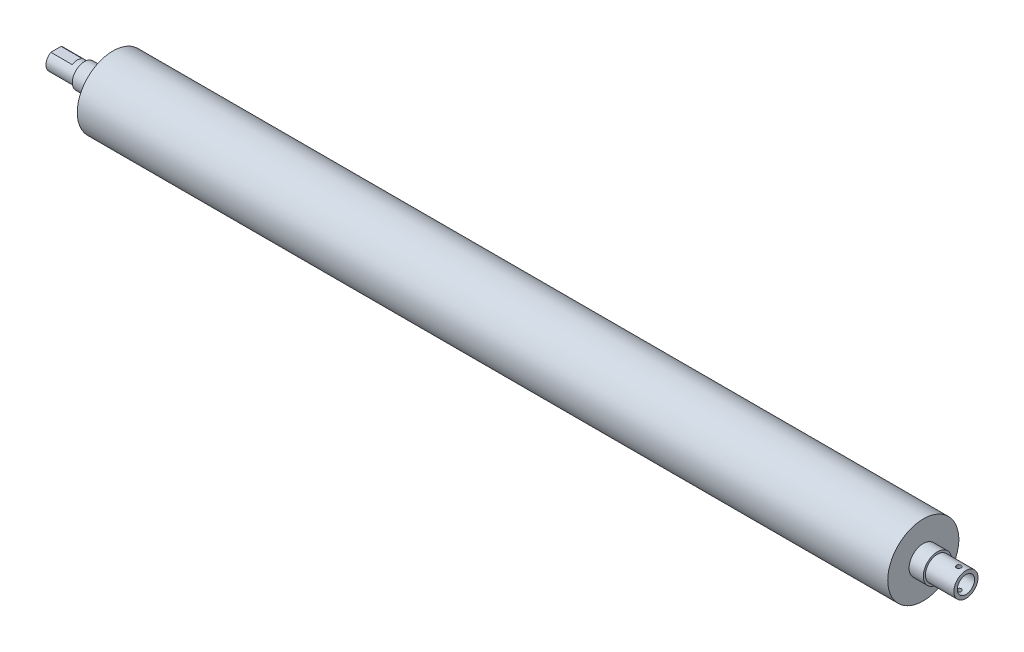
ISO-10303-21;
HEADER;
FILE_DESCRIPTION(('STEP AP214'),'2;1');
FILE_NAME('part.step','',(''),(''),'','','');
FILE_SCHEMA(('AUTOMOTIVE_DESIGN { 1 0 10303 214 1 1 1 1 }'));
ENDSEC;
DATA;
#1=APPLICATION_CONTEXT('core data for automotive mechanical design processes');
#2=APPLICATION_PROTOCOL_DEFINITION('international standard','automotive_design',2000,#1);
#3=PRODUCT_CONTEXT('',#1,'mechanical');
#4=PRODUCT('Part','Part','',(#3));
#5=PRODUCT_RELATED_PRODUCT_CATEGORY('part','',(#4));
#6=PRODUCT_DEFINITION_FORMATION('','',#4);
#7=PRODUCT_DEFINITION_CONTEXT('part definition',#1,'design');
#8=PRODUCT_DEFINITION('design','',#6,#7);
#9=PRODUCT_DEFINITION_SHAPE('','',#8);
#10=(LENGTH_UNIT() NAMED_UNIT(*) SI_UNIT(.MILLI.,.METRE.));
#11=(NAMED_UNIT(*) PLANE_ANGLE_UNIT() SI_UNIT($,.RADIAN.));
#12=(NAMED_UNIT(*) SI_UNIT($,.STERADIAN.) SOLID_ANGLE_UNIT());
#13=UNCERTAINTY_MEASURE_WITH_UNIT(LENGTH_MEASURE(1.E-05),#10,'distance_accuracy_value','');
#14=(GEOMETRIC_REPRESENTATION_CONTEXT(3) GLOBAL_UNCERTAINTY_ASSIGNED_CONTEXT((#13)) GLOBAL_UNIT_ASSIGNED_CONTEXT((#10,
#11,#12)) REPRESENTATION_CONTEXT('',''));
#15=CARTESIAN_POINT('',(0.,0.,0.));
#16=DIRECTION('',(0.,0.,1.));
#17=DIRECTION('',(1.,0.,0.));
#18=AXIS2_PLACEMENT_3D('',#15,#16,#17);
#19=CARTESIAN_POINT('',(-65.5594140978053,7.,0.));
#20=DIRECTION('',(1.,0.,0.));
#21=DIRECTION('',(0.,0.,-1.));
#22=AXIS2_PLACEMENT_3D('',#19,#20,#21);
#23=PLANE('',#22);
#24=CARTESIAN_POINT('',(-65.5594140978053,0.,0.));
#25=DIRECTION('',(-1.,0.,0.));
#26=DIRECTION('',(0.,0.,1.));
#27=AXIS2_PLACEMENT_3D('',#24,#25,#26);
#28=CIRCLE('',#27,7.);
#29=CARTESIAN_POINT('',(-65.5594140978053,6.,-3.60555127546399));
#30=VERTEX_POINT('',#29);
#31=CARTESIAN_POINT('',(-65.5594140978053,6.,3.60555127546399));
#32=VERTEX_POINT('',#31);
#33=EDGE_CURVE('E123',#30,#32,#28,.T.);
#34=ORIENTED_EDGE('',*,*,#33,.T.);
#35=DIRECTION('',(0.,0.,1.));
#36=VECTOR('',#35,1.);
#37=CARTESIAN_POINT('',(-65.5594140978053,6.,-8.));
#38=LINE('',#37,#36);
#39=EDGE_CURVE('E80',#30,#32,#38,.T.);
#40=ORIENTED_EDGE('',*,*,#39,.F.);
#41=EDGE_LOOP('',(#34,#40));
#42=FACE_BOUND('',#41,.T.);
#43=ADVANCED_FACE('F36',(#42),#23,.F.);
#44=CARTESIAN_POINT('',(-62.7058823529411,0.,0.));
#45=DIRECTION('',(-1.,0.,0.));
#46=DIRECTION('',(0.,0.,1.));
#47=AXIS2_PLACEMENT_3D('',#44,#45,#46);
#48=CYLINDRICAL_SURFACE('',#47,7.);
#49=CARTESIAN_POINT('',(-50.5594140978053,0.,0.));
#50=DIRECTION('',(-1.,0.,0.));
#51=DIRECTION('',(0.,0.,1.));
#52=AXIS2_PLACEMENT_3D('',#49,#50,#51);
#53=CIRCLE('',#52,7.);
#54=CARTESIAN_POINT('',(-50.5594140978053,6.,3.60555127546399));
#55=VERTEX_POINT('',#54);
#56=CARTESIAN_POINT('',(-50.5594140978053,6.,-3.60555127546399));
#57=VERTEX_POINT('',#56);
#58=EDGE_CURVE('E60',#55,#57,#53,.T.);
#59=ORIENTED_EDGE('',*,*,#58,.F.);
#60=DIRECTION('',(-1.,0.,0.));
#61=VECTOR('',#60,1.);
#62=CARTESIAN_POINT('',(-62.7058823529411,6.,3.60555127546399));
#63=LINE('',#62,#61);
#64=EDGE_CURVE('E11',#55,#32,#63,.T.);
#65=ORIENTED_EDGE('',*,*,#64,.T.);
#66=ORIENTED_EDGE('',*,*,#33,.F.);
#67=DIRECTION('',(-1.,0.,0.));
#68=VECTOR('',#67,1.);
#69=CARTESIAN_POINT('',(-62.7058823529411,6.,-3.60555127546399));
#70=LINE('',#69,#68);
#71=EDGE_CURVE('E49',#30,#57,#70,.F.);
#72=ORIENTED_EDGE('',*,*,#71,.T.);
#73=EDGE_LOOP('',(#59,#65,#66,#72));
#74=FACE_BOUND('',#73,.T.);
#75=CARTESIAN_POINT('',(-45.5594140978053,0.,0.));
#76=DIRECTION('',(-1.,0.,0.));
#77=DIRECTION('',(0.,0.,1.));
#78=AXIS2_PLACEMENT_3D('',#75,#76,#77);
#79=CIRCLE('',#78,7.);
#80=CARTESIAN_POINT('',(-45.5594140978053,0.,7.));
#81=VERTEX_POINT('',#80);
#82=EDGE_CURVE('E120',#81,#81,#79,.T.);
#83=ORIENTED_EDGE('',*,*,#82,.T.);
#84=EDGE_LOOP('',(#83));
#85=FACE_BOUND('',#84,.T.);
#86=ADVANCED_FACE('F195',(#74,#85),#48,.T.);
#87=CARTESIAN_POINT('',(-45.5594140978053,8.5,0.));
#88=DIRECTION('',(1.,0.,0.));
#89=DIRECTION('',(0.,0.,-1.));
#90=AXIS2_PLACEMENT_3D('',#87,#88,#89);
#91=PLANE('',#90);
#92=ORIENTED_EDGE('',*,*,#82,.F.);
#93=EDGE_LOOP('',(#92));
#94=FACE_BOUND('',#93,.T.);
#95=CARTESIAN_POINT('',(-45.5594140978053,0.,0.));
#96=DIRECTION('',(-1.,0.,0.));
#97=DIRECTION('',(0.,0.,1.));
#98=AXIS2_PLACEMENT_3D('',#95,#96,#97);
#99=CIRCLE('',#98,8.5);
#100=CARTESIAN_POINT('',(-45.5594140978053,0.,8.5));
#101=VERTEX_POINT('',#100);
#102=EDGE_CURVE('E117',#101,#101,#99,.T.);
#103=ORIENTED_EDGE('',*,*,#102,.T.);
#104=EDGE_LOOP('',(#103));
#105=FACE_BOUND('',#104,.T.);
#106=ADVANCED_FACE('F192',(#94,#105),#91,.F.);
#107=CARTESIAN_POINT('',(-62.7058823529411,0.,0.));
#108=DIRECTION('',(-1.,0.,0.));
#109=DIRECTION('',(0.,0.,1.));
#110=AXIS2_PLACEMENT_3D('',#107,#108,#109);
#111=CYLINDRICAL_SURFACE('',#110,8.5);
#112=ORIENTED_EDGE('',*,*,#102,.F.);
#113=EDGE_LOOP('',(#112));
#114=FACE_BOUND('',#113,.T.);
#115=CARTESIAN_POINT('',(-35.5594140978053,0.,0.));
#116=DIRECTION('',(-1.,0.,0.));
#117=DIRECTION('',(0.,0.,1.));
#118=AXIS2_PLACEMENT_3D('',#115,#116,#117);
#119=CIRCLE('',#118,8.5);
#120=CARTESIAN_POINT('',(-35.5594140978053,0.,8.5));
#121=VERTEX_POINT('',#120);
#122=EDGE_CURVE('E114',#121,#121,#119,.T.);
#123=ORIENTED_EDGE('',*,*,#122,.T.);
#124=EDGE_LOOP('',(#123));
#125=FACE_BOUND('',#124,.T.);
#126=ADVANCED_FACE('F188',(#114,#125),#111,.T.);
#127=CARTESIAN_POINT('',(-35.5594140978053,10.,0.));
#128=DIRECTION('',(1.,0.,0.));
#129=DIRECTION('',(0.,0.,-1.));
#130=AXIS2_PLACEMENT_3D('',#127,#128,#129);
#131=PLANE('',#130);
#132=ORIENTED_EDGE('',*,*,#122,.F.);
#133=EDGE_LOOP('',(#132));
#134=FACE_BOUND('',#133,.T.);
#135=CARTESIAN_POINT('',(-35.5594140978053,0.,0.));
#136=DIRECTION('',(-1.,0.,0.));
#137=DIRECTION('',(0.,0.,1.));
#138=AXIS2_PLACEMENT_3D('',#135,#136,#137);
#139=CIRCLE('',#138,10.);
#140=CARTESIAN_POINT('',(-35.5594140978053,0.,10.));
#141=VERTEX_POINT('',#140);
#142=EDGE_CURVE('E111',#141,#141,#139,.T.);
#143=ORIENTED_EDGE('',*,*,#142,.T.);
#144=EDGE_LOOP('',(#143));
#145=FACE_BOUND('',#144,.T.);
#146=ADVANCED_FACE('F184',(#134,#145),#131,.F.);
#147=CARTESIAN_POINT('',(-62.7058823529411,0.,0.));
#148=DIRECTION('',(-1.,0.,0.));
#149=DIRECTION('',(0.,0.,1.));
#150=AXIS2_PLACEMENT_3D('',#147,#148,#149);
#151=CYLINDRICAL_SURFACE('',#150,10.);
#152=ORIENTED_EDGE('',*,*,#142,.F.);
#153=EDGE_LOOP('',(#152));
#154=FACE_BOUND('',#153,.T.);
#155=CARTESIAN_POINT('',(-25.5594140978053,0.,0.));
#156=DIRECTION('',(-1.,0.,0.));
#157=DIRECTION('',(0.,0.,1.));
#158=AXIS2_PLACEMENT_3D('',#155,#156,#157);
#159=CIRCLE('',#158,10.);
#160=CARTESIAN_POINT('',(-25.5594140978053,0.,10.));
#161=VERTEX_POINT('',#160);
#162=EDGE_CURVE('E108',#161,#161,#159,.T.);
#163=ORIENTED_EDGE('',*,*,#162,.T.);
#164=EDGE_LOOP('',(#163));
#165=FACE_BOUND('',#164,.T.);
#166=ADVANCED_FACE('F180',(#154,#165),#151,.T.);
#167=CARTESIAN_POINT('',(-25.5594140978053,24.9999999999999,0.));
#168=DIRECTION('',(1.,0.,0.));
#169=DIRECTION('',(0.,0.,-1.));
#170=AXIS2_PLACEMENT_3D('',#167,#168,#169);
#171=PLANE('',#170);
#172=ORIENTED_EDGE('',*,*,#162,.F.);
#173=EDGE_LOOP('',(#172));
#174=FACE_BOUND('',#173,.T.);
#175=CARTESIAN_POINT('',(-25.5594140978053,0.,0.));
#176=DIRECTION('',(-1.,0.,0.));
#177=DIRECTION('',(0.,0.,1.));
#178=AXIS2_PLACEMENT_3D('',#175,#176,#177);
#179=CIRCLE('',#178,24.9999999999999);
#180=CARTESIAN_POINT('',(-25.5594140978053,0.,24.9999999999999));
#181=VERTEX_POINT('',#180);
#182=EDGE_CURVE('E105',#181,#181,#179,.T.);
#183=ORIENTED_EDGE('',*,*,#182,.T.);
#184=EDGE_LOOP('',(#183));
#185=FACE_BOUND('',#184,.T.);
#186=ADVANCED_FACE('F176',(#174,#185),#171,.F.);
#187=CARTESIAN_POINT('',(-62.7058823529411,0.,0.));
#188=DIRECTION('',(-1.,0.,0.));
#189=DIRECTION('',(0.,0.,1.));
#190=AXIS2_PLACEMENT_3D('',#187,#188,#189);
#191=CYLINDRICAL_SURFACE('',#190,25.);
#192=ORIENTED_EDGE('',*,*,#182,.F.);
#193=EDGE_LOOP('',(#192));
#194=FACE_BOUND('',#193,.T.);
#195=CARTESIAN_POINT('',(544.440585902195,0.,0.));
#196=DIRECTION('',(-1.,0.,0.));
#197=DIRECTION('',(0.,0.,1.));
#198=AXIS2_PLACEMENT_3D('',#195,#196,#197);
#199=CIRCLE('',#198,25.);
#200=CARTESIAN_POINT('',(544.440585902195,0.,25.));
#201=VERTEX_POINT('',#200);
#202=EDGE_CURVE('E102',#201,#201,#199,.T.);
#203=ORIENTED_EDGE('',*,*,#202,.T.);
#204=EDGE_LOOP('',(#203));
#205=FACE_BOUND('',#204,.T.);
#206=ADVANCED_FACE('F172',(#194,#205),#191,.T.);
#207=CARTESIAN_POINT('',(544.440585902195,10.0000000000001,0.));
#208=DIRECTION('',(-1.,0.,0.));
#209=DIRECTION('',(0.,0.,1.));
#210=AXIS2_PLACEMENT_3D('',#207,#208,#209);
#211=PLANE('',#210);
#212=ORIENTED_EDGE('',*,*,#202,.F.);
#213=EDGE_LOOP('',(#212));
#214=FACE_BOUND('',#213,.T.);
#215=CARTESIAN_POINT('',(544.440585902195,0.,0.));
#216=DIRECTION('',(-1.,0.,0.));
#217=DIRECTION('',(0.,0.,1.));
#218=AXIS2_PLACEMENT_3D('',#215,#216,#217);
#219=CIRCLE('',#218,10.0000000000001);
#220=CARTESIAN_POINT('',(544.440585902195,0.,10.0000000000001));
#221=VERTEX_POINT('',#220);
#222=EDGE_CURVE('E99',#221,#221,#219,.T.);
#223=ORIENTED_EDGE('',*,*,#222,.T.);
#224=EDGE_LOOP('',(#223));
#225=FACE_BOUND('',#224,.T.);
#226=ADVANCED_FACE('F168',(#214,#225),#211,.F.);
#227=CARTESIAN_POINT('',(-62.7058823529411,0.,0.));
#228=DIRECTION('',(-1.,0.,0.));
#229=DIRECTION('',(0.,0.,1.));
#230=AXIS2_PLACEMENT_3D('',#227,#228,#229);
#231=CYLINDRICAL_SURFACE('',#230,10.0000000000001);
#232=ORIENTED_EDGE('',*,*,#222,.F.);
#233=EDGE_LOOP('',(#232));
#234=FACE_BOUND('',#233,.T.);
#235=CARTESIAN_POINT('',(554.440585902195,0.,0.));
#236=DIRECTION('',(-1.,0.,0.));
#237=DIRECTION('',(0.,0.,1.));
#238=AXIS2_PLACEMENT_3D('',#235,#236,#237);
#239=CIRCLE('',#238,10.0000000000001);
#240=CARTESIAN_POINT('',(554.440585902195,0.,10.0000000000001));
#241=VERTEX_POINT('',#240);
#242=EDGE_CURVE('E96',#241,#241,#239,.T.);
#243=ORIENTED_EDGE('',*,*,#242,.T.);
#244=EDGE_LOOP('',(#243));
#245=FACE_BOUND('',#244,.T.);
#246=ADVANCED_FACE('F164',(#234,#245),#231,.T.);
#247=CARTESIAN_POINT('',(554.440585902195,10.0000000000001,0.));
#248=DIRECTION('',(-1.,0.,0.));
#249=DIRECTION('',(0.,0.,1.));
#250=AXIS2_PLACEMENT_3D('',#247,#248,#249);
#251=PLANE('',#250);
#252=ORIENTED_EDGE('',*,*,#242,.F.);
#253=EDGE_LOOP('',(#252));
#254=FACE_BOUND('',#253,.T.);
#255=CARTESIAN_POINT('',(554.440585902195,0.,0.));
#256=DIRECTION('',(-1.,0.,0.));
#257=DIRECTION('',(0.,0.,1.));
#258=AXIS2_PLACEMENT_3D('',#255,#256,#257);
#259=CIRCLE('',#258,8.50000000000007);
#260=CARTESIAN_POINT('',(554.440585902195,0.,8.50000000000007));
#261=VERTEX_POINT('',#260);
#262=EDGE_CURVE('E93',#261,#261,#259,.T.);
#263=ORIENTED_EDGE('',*,*,#262,.T.);
#264=EDGE_LOOP('',(#263));
#265=FACE_BOUND('',#264,.T.);
#266=ADVANCED_FACE('F158',(#254,#265),#251,.F.);
#267=CARTESIAN_POINT('',(-62.7058823529411,0.,0.));
#268=DIRECTION('',(-1.,0.,0.));
#269=DIRECTION('',(0.,0.,1.));
#270=AXIS2_PLACEMENT_3D('',#267,#268,#269);
#271=CYLINDRICAL_SURFACE('',#270,8.50000000000007);
#272=CARTESIAN_POINT('',(569.440585902195,-8.33831517754043,1.65000000000004));
#273=CARTESIAN_POINT('',(569.532325396756,-8.33831698113522,1.6499965458441));
#274=CARTESIAN_POINT('',(569.624109015812,-8.33984562808629,1.64232299568279));
#275=CARTESIAN_POINT('',(569.805083784387,-8.34578672369102,1.61185478162252));
#276=CARTESIAN_POINT('',(569.894272736742,-8.35020154614166,1.58904767056992));
#277=CARTESIAN_POINT('',(570.067413601714,-8.36139657192931,1.52904282723215));
#278=CARTESIAN_POINT('',(570.151370474562,-8.36817449346449,1.49185897332865));
#279=CARTESIAN_POINT('',(570.311850523675,-8.38332930931024,1.40419357245979));
#280=CARTESIAN_POINT('',(570.388374193108,-8.39170609743217,1.35371290851683));
#281=CARTESIAN_POINT('',(570.532840437181,-8.40923952487657,1.24016959557924));
#282=CARTESIAN_POINT('',(570.60066952485,-8.41840428803632,1.17696378410953));
#283=CARTESIAN_POINT('',(570.724831372253,-8.43640940764757,1.04007371819231));
#284=CARTESIAN_POINT('',(570.781163350873,-8.44524974202392,0.966388752366878));
#285=CARTESIAN_POINT('',(570.881169680303,-8.4616972760906,0.809883405698716));
#286=CARTESIAN_POINT('',(570.924736587369,-8.46929378350965,0.726993148749811));
#287=CARTESIAN_POINT('',(570.99728327415,-8.48230663974876,0.554897288771665));
#288=CARTESIAN_POINT('',(571.026264339639,-8.48772318072919,0.465692243195918));
#289=CARTESIAN_POINT('',(571.068464514991,-8.49570841983855,0.284675958249688));
#290=CARTESIAN_POINT('',(571.081875110612,-8.49831168741397,0.192910910072342));
#291=CARTESIAN_POINT('',(571.093150719808,-8.50049633977496,0.00839893937507622));
#292=CARTESIAN_POINT('',(571.091017148082,-8.50007799956197,-0.0843478930239022));
#293=CARTESIAN_POINT('',(571.071410997271,-8.49629346800809,-0.266876138201355));
#294=CARTESIAN_POINT('',(571.054144641254,-8.49296691012224,-0.35668064321085));
#295=CARTESIAN_POINT('',(571.00508969956,-8.48378429517967,-0.532092958251835));
#296=CARTESIAN_POINT('',(570.973300557121,-8.47792814114614,-0.61770060724886));
#297=CARTESIAN_POINT('',(570.895908773624,-8.46427857123539,-0.782882145301481));
#298=CARTESIAN_POINT('',(570.850224554221,-8.45647376460308,-0.862416833091235));
#299=CARTESIAN_POINT('',(570.746399665649,-8.43978859795571,-1.01276800571321));
#300=CARTESIAN_POINT('',(570.688257642541,-8.43090812108028,-1.08358354161213));
#301=CARTESIAN_POINT('',(570.56003382265,-8.41288167589603,-1.21570911700118));
#302=CARTESIAN_POINT('',(570.489771572829,-8.40373374274393,-1.27684389120412));
#303=CARTESIAN_POINT('',(570.339900607958,-8.38634230598407,-1.38648978732331));
#304=CARTESIAN_POINT('',(570.260291735998,-8.37809881756441,-1.43500069726913));
#305=CARTESIAN_POINT('',(570.093744879398,-8.36344623555512,-1.51807723517805));
#306=CARTESIAN_POINT('',(570.006793102061,-8.35704069818371,-1.55261588065737));
#307=CARTESIAN_POINT('',(569.828167893596,-8.3468424982212,-1.60654321302855));
#308=CARTESIAN_POINT('',(569.73649504063,-8.34304951650008,-1.62593375033743));
#309=CARTESIAN_POINT('',(569.552614587456,-8.33856943969917,-1.64875539263458));
#310=CARTESIAN_POINT('',(569.460439486049,-8.33783321457746,-1.65243897562149));
#311=CARTESIAN_POINT('',(569.276791610263,-8.33941832618171,-1.64442029839138));
#312=CARTESIAN_POINT('',(569.185318798767,-8.34173950018338,-1.63271885701327));
#313=CARTESIAN_POINT('',(569.006511811799,-8.3491319802523,-1.59447951985242));
#314=CARTESIAN_POINT('',(568.91914792926,-8.3541784939871,-1.56807530840786));
#315=CARTESIAN_POINT('',(568.75008414179,-8.36643148072371,-1.50132236589541));
#316=CARTESIAN_POINT('',(568.668384680765,-8.37363812277416,-1.46097254342549));
#317=CARTESIAN_POINT('',(568.511860515163,-8.38951045394452,-1.3668976670972));
#318=CARTESIAN_POINT('',(568.437132941385,-8.39819302947797,-1.31301390845285));
#319=CARTESIAN_POINT('',(568.29768863208,-8.4159920330001,-1.19361344448673));
#320=CARTESIAN_POINT('',(568.232972865546,-8.42510850287171,-1.12809561447806));
#321=CARTESIAN_POINT('',(568.114438655966,-8.44290679899307,-0.986156152541187));
#322=CARTESIAN_POINT('',(568.060790490293,-8.45158047945524,-0.909591136547592));
#323=CARTESIAN_POINT('',(567.967119244133,-8.46737647548233,-0.748388224061612));
#324=CARTESIAN_POINT('',(567.927095613504,-8.47449885368275,-0.663750653705873));
#325=CARTESIAN_POINT('',(567.862060967335,-8.48635484464958,-0.489263714493104));
#326=CARTESIAN_POINT('',(567.836968179743,-8.49110144571442,-0.399445745153061));
#327=CARTESIAN_POINT('',(567.802247497728,-8.49772663425004,-0.216768885986772));
#328=CARTESIAN_POINT('',(567.792617853594,-8.4996055462088,-0.123910341425868));
#329=CARTESIAN_POINT('',(567.789161304286,-8.50027656489911,0.0605822198028854));
#330=CARTESIAN_POINT('',(567.795077838256,-8.49911878713473,0.152211345149231));
#331=CARTESIAN_POINT('',(567.82198140025,-8.49395129578565,0.33314332646085));
#332=CARTESIAN_POINT('',(567.842968260851,-8.48994161388423,0.42244620825814));
#333=CARTESIAN_POINT('',(567.899305503097,-8.47952157392234,0.596042436980575));
#334=CARTESIAN_POINT('',(567.934626733747,-8.47311609012794,0.680345555198073));
#335=CARTESIAN_POINT('',(568.018598464841,-8.45859591220448,0.841866215165978));
#336=CARTESIAN_POINT('',(568.067249942999,-8.45048109271329,0.919083236627683));
#337=CARTESIAN_POINT('',(568.177375038808,-8.43327970586316,1.06551314009858));
#338=CARTESIAN_POINT('',(568.239033077519,-8.42418019390974,1.13458582031076));
#339=CARTESIAN_POINT('',(568.373040291796,-8.40611415030443,1.26149270349606));
#340=CARTESIAN_POINT('',(568.445391986602,-8.39714765053712,1.31932425079936));
#341=CARTESIAN_POINT('',(568.599602766779,-8.38026411985673,1.42265582279933));
#342=CARTESIAN_POINT('',(568.68154998109,-8.37235852454968,1.46802626325667));
#343=CARTESIAN_POINT('',(568.852033097497,-8.35863054933981,1.54428259370779));
#344=CARTESIAN_POINT('',(568.940562818129,-8.35280624406749,1.57518187900872));
#345=CARTESIAN_POINT('',(569.09786645562,-8.34508778751039,1.61548885886867));
#346=CARTESIAN_POINT('',(569.165731544633,-8.34256348257586,1.62840785060953));
#347=CARTESIAN_POINT('',(569.302584756102,-8.33917652483713,1.64566458797868));
#348=CARTESIAN_POINT('',(569.37157284383,-8.33831382074647,1.65000259846504));
#349=CARTESIAN_POINT('',(569.440585902195,-8.33831517754043,1.65000000000004));
#350=B_SPLINE_CURVE_WITH_KNOTS('',3,(#272,#273,#274,#275,#276,#277,#278,#279,#280,#281,#282,
#283,#284,#285,#286,#287,#288,#289,#290,#291,#292,#293,#294,#295,#296,#297,#298,#299,#300,#301,
#302,#303,#304,#305,#306,#307,#308,#309,#310,#311,#312,#313,#314,#315,#316,#317,#318,#319,#320,
#321,#322,#323,#324,#325,#326,#327,#328,#329,#330,#331,#332,#333,#334,#335,#336,#337,#338,#339,
#340,#341,#342,#343,#344,#345,#346,#347,#348,#349),.UNSPECIFIED.,.T.,.F.,(4,2,2,2,2,2,2,2,2,2,2,
2,2,2,2,2,2,2,2,2,2,2,2,2,2,2,2,2,2,2,2,2,2,2,2,2,2,2,4),(0.,0.274965859742001,
0.550158156059183,0.82508546006245,1.09999451113195,1.37818912456844,1.65640263228338,
1.93689469309276,2.21736202357975,2.49434235517803,2.77129747866229,3.04453605613463,
3.31778510965009,3.59267043854071,3.86758565768976,4.14701712256036,4.42645327913105,
4.7064265208619,4.98636555711372,5.26178739990586,5.53719458448352,5.81013759309073,
6.08310196741877,6.35943028424898,6.6357853287993,6.9161185097651,7.19644036987462,
7.47521250706629,7.75395309797981,8.02812259654245,8.30228904926206,8.57590071708952,
8.84953245849981,9.12734186132884,9.40521681589094,9.68588052782324,9.96628392578434,
10.1731394437886,10.3799885769509),.UNSPECIFIED.);
#351=CARTESIAN_POINT('',(569.440585902195,-8.33831517754043,1.65000000000004));
#352=VERTEX_POINT('',#351);
#353=EDGE_CURVE('E85',#352,#352,#350,.T.);
#354=ORIENTED_EDGE('',*,*,#353,.T.);
#355=EDGE_LOOP('',(#354));
#356=FACE_BOUND('',#355,.T.);
#357=CARTESIAN_POINT('',(569.440585902195,8.33831517754043,1.65000000000004));
#358=CARTESIAN_POINT('',(569.348846407634,8.33831698113522,1.6499965458441));
#359=CARTESIAN_POINT('',(569.257062788577,8.33984562808629,1.64232299568279));
#360=CARTESIAN_POINT('',(569.076088020002,8.34578672369102,1.61185478162253));
#361=CARTESIAN_POINT('',(568.986899067647,8.35020154614166,1.58904767056992));
#362=CARTESIAN_POINT('',(568.813758202675,8.36139657192931,1.52904282723215));
#363=CARTESIAN_POINT('',(568.729801329828,8.36817449346449,1.49185897332865));
#364=CARTESIAN_POINT('',(568.569321280714,8.38332930931024,1.40419357245979));
#365=CARTESIAN_POINT('',(568.492797611281,8.39170609743217,1.35371290851683));
#366=CARTESIAN_POINT('',(568.348331367208,8.40923952487657,1.24016959557924));
#367=CARTESIAN_POINT('',(568.28050227954,8.41840428803632,1.17696378410953));
#368=CARTESIAN_POINT('',(568.156340432136,8.43640940764757,1.04007371819231));
#369=CARTESIAN_POINT('',(568.100008453516,8.44524974202392,0.966388752366878));
#370=CARTESIAN_POINT('',(568.000002124087,8.4616972760906,0.809883405698716));
#371=CARTESIAN_POINT('',(567.95643521702,8.46929378350965,0.726993148749811));
#372=CARTESIAN_POINT('',(567.883888530239,8.48230663974876,0.554897288771665));
#373=CARTESIAN_POINT('',(567.85490746475,8.48772318072919,0.465692243195918));
#374=CARTESIAN_POINT('',(567.812707289398,8.49570841983855,0.28467595824969));
#375=CARTESIAN_POINT('',(567.799296693777,8.49831168741397,0.192910910072346));
#376=CARTESIAN_POINT('',(567.788021084581,8.50049633977496,0.00839893937508103));
#377=CARTESIAN_POINT('',(567.790154656307,8.50007799956197,-0.084347893023899));
#378=CARTESIAN_POINT('',(567.809760807118,8.49629346800809,-0.266876138201375));
#379=CARTESIAN_POINT('',(567.827027163135,8.49296691012224,-0.356680643210891));
#380=CARTESIAN_POINT('',(567.876082104829,8.48378429517967,-0.532092958251873));
#381=CARTESIAN_POINT('',(567.907871247268,8.47792814114614,-0.617700607248878));
#382=CARTESIAN_POINT('',(567.985263030765,8.46427857123539,-0.782882145301479));
#383=CARTESIAN_POINT('',(568.030947250169,8.45647376460308,-0.862416833091234));
#384=CARTESIAN_POINT('',(568.13477213874,8.43978859795571,-1.01276800571321));
#385=CARTESIAN_POINT('',(568.192914161848,8.43090812108028,-1.08358354161213));
#386=CARTESIAN_POINT('',(568.321137981739,8.41288167589603,-1.21570911700118));
#387=CARTESIAN_POINT('',(568.39140023156,8.40373374274393,-1.27684389120412));
#388=CARTESIAN_POINT('',(568.541271196431,8.38634230598407,-1.38648978732331));
#389=CARTESIAN_POINT('',(568.620880068391,8.37809881756441,-1.43500069726913));
#390=CARTESIAN_POINT('',(568.787426924991,8.36344623555512,-1.51807723517805));
#391=CARTESIAN_POINT('',(568.874378702328,8.35704069818371,-1.55261588065737));
#392=CARTESIAN_POINT('',(569.053003910793,8.3468424982212,-1.60654321302855));
#393=CARTESIAN_POINT('',(569.14467676376,8.34304951650008,-1.62593375033743));
#394=CARTESIAN_POINT('',(569.328557216933,8.33856943969917,-1.64875539263458));
#395=CARTESIAN_POINT('',(569.42073231834,8.33783321457746,-1.65243897562149));
#396=CARTESIAN_POINT('',(569.604380194126,8.33941832618171,-1.64442029839138));
#397=CARTESIAN_POINT('',(569.695853005622,8.34173950018338,-1.63271885701327));
#398=CARTESIAN_POINT('',(569.87465999259,8.3491319802523,-1.59447951985242));
#399=CARTESIAN_POINT('',(569.962023875129,8.3541784939871,-1.56807530840786));
#400=CARTESIAN_POINT('',(570.131087662599,8.36643148072371,-1.50132236589541));
#401=CARTESIAN_POINT('',(570.212787123625,8.37363812277416,-1.46097254342549));
#402=CARTESIAN_POINT('',(570.369311289227,8.38951045394452,-1.3668976670972));
#403=CARTESIAN_POINT('',(570.444038863004,8.39819302947797,-1.31301390845285));
#404=CARTESIAN_POINT('',(570.583483172309,8.4159920330001,-1.19361344448673));
#405=CARTESIAN_POINT('',(570.648198938844,8.42510850287171,-1.12809561447806));
#406=CARTESIAN_POINT('',(570.766733148423,8.44290679899307,-0.986156152541187));
#407=CARTESIAN_POINT('',(570.820381314097,8.45158047945524,-0.909591136547592));
#408=CARTESIAN_POINT('',(570.914052560257,8.46737647548233,-0.748388224061612));
#409=CARTESIAN_POINT('',(570.954076190885,8.47449885368275,-0.663750653705873));
#410=CARTESIAN_POINT('',(571.019110837054,8.48635484464958,-0.489263714493104));
#411=CARTESIAN_POINT('',(571.044203624646,8.49110144571442,-0.399445745153062));
#412=CARTESIAN_POINT('',(571.078924306661,8.49772663425004,-0.216768885986772));
#413=CARTESIAN_POINT('',(571.088553950795,8.4996055462088,-0.123910341425868));
#414=CARTESIAN_POINT('',(571.092010500103,8.50027656489911,0.0605822198028852));
#415=CARTESIAN_POINT('',(571.086093966133,8.49911878713473,0.15221134514923));
#416=CARTESIAN_POINT('',(571.059190404139,8.49395129578565,0.333143326460851));
#417=CARTESIAN_POINT('',(571.038203543539,8.48994161388423,0.422446208258142));
#418=CARTESIAN_POINT('',(570.981866301293,8.47952157392235,0.596042436980559));
#419=CARTESIAN_POINT('',(570.946545070642,8.47311609012794,0.680345555198039));
#420=CARTESIAN_POINT('',(570.862573339548,8.45859591220448,0.841866215165946));
#421=CARTESIAN_POINT('',(570.813921861391,8.45048109271329,0.91908323662767));
#422=CARTESIAN_POINT('',(570.703796765581,8.43327970586316,1.06551314009858));
#423=CARTESIAN_POINT('',(570.64213872687,8.42418019390974,1.13458582031077));
#424=CARTESIAN_POINT('',(570.508131512594,8.40611415030443,1.26149270349606));
#425=CARTESIAN_POINT('',(570.435779817787,8.39714765053712,1.31932425079936));
#426=CARTESIAN_POINT('',(570.28156903761,8.38026411985674,1.42265582279931));
#427=CARTESIAN_POINT('',(570.199621823299,8.37235852454969,1.46802626325664));
#428=CARTESIAN_POINT('',(570.029138706892,8.35863054933981,1.54428259370777));
#429=CARTESIAN_POINT('',(569.94060898626,8.35280624406749,1.57518187900871));
#430=CARTESIAN_POINT('',(569.783305348769,8.34508778751039,1.61548885886867));
#431=CARTESIAN_POINT('',(569.715440259756,8.34256348257586,1.62840785060953));
#432=CARTESIAN_POINT('',(569.578587048287,8.33917652483713,1.64566458797868));
#433=CARTESIAN_POINT('',(569.509598960559,8.33831382074647,1.65000259846504));
#434=CARTESIAN_POINT('',(569.440585902195,8.33831517754043,1.65000000000004));
#435=B_SPLINE_CURVE_WITH_KNOTS('',3,(#357,#358,#359,#360,#361,#362,#363,#364,#365,#366,#367,
#368,#369,#370,#371,#372,#373,#374,#375,#376,#377,#378,#379,#380,#381,#382,#383,#384,#385,#386,
#387,#388,#389,#390,#391,#392,#393,#394,#395,#396,#397,#398,#399,#400,#401,#402,#403,#404,#405,
#406,#407,#408,#409,#410,#411,#412,#413,#414,#415,#416,#417,#418,#419,#420,#421,#422,#423,#424,
#425,#426,#427,#428,#429,#430,#431,#432,#433,#434),.UNSPECIFIED.,.T.,.F.,(4,2,2,2,2,2,2,2,2,2,2,
2,2,2,2,2,2,2,2,2,2,2,2,2,2,2,2,2,2,2,2,2,2,2,2,2,2,2,4),(0.,0.274965859742001,
0.550158156059183,0.82508546006245,1.09999451113195,1.37818912456844,1.65640263228338,
1.93689469309276,2.21736202357975,2.49434235517802,2.77129747866229,3.04453605613469,
3.31778510965009,3.59267043854071,3.86758565768977,4.14701712256036,4.42645327913105,
4.7064265208619,4.98636555711373,5.26178739990586,5.53719458448352,5.81013759309074,
6.08310196741877,6.35943028424898,6.6357853287993,6.9161185097651,7.19644036987462,
7.47521250706629,7.75395309797982,8.02812259654245,8.30228904926206,8.57590071708948,
8.8495324584998,9.12734186132884,9.40521681589094,9.68588052782312,9.96628392578434,
10.1731394437886,10.3799885769509),.UNSPECIFIED.);
#436=CARTESIAN_POINT('',(569.440585902195,8.33831517754043,1.65000000000004));
#437=VERTEX_POINT('',#436);
#438=EDGE_CURVE('E143',#437,#437,#435,.T.);
#439=ORIENTED_EDGE('',*,*,#438,.T.);
#440=EDGE_LOOP('',(#439));
#441=FACE_BOUND('',#440,.T.);
#442=ORIENTED_EDGE('',*,*,#262,.F.);
#443=EDGE_LOOP('',(#442));
#444=FACE_BOUND('',#443,.T.);
#445=CARTESIAN_POINT('',(574.440585902195,0.,0.));
#446=DIRECTION('',(-1.,0.,0.));
#447=DIRECTION('',(0.,0.,1.));
#448=AXIS2_PLACEMENT_3D('',#445,#446,#447);
#449=CIRCLE('',#448,8.50000000000007);
#450=CARTESIAN_POINT('',(574.440585902195,0.,8.50000000000007));
#451=VERTEX_POINT('',#450);
#452=EDGE_CURVE('E89',#451,#451,#449,.T.);
#453=ORIENTED_EDGE('',*,*,#452,.T.);
#454=EDGE_LOOP('',(#453));
#455=FACE_BOUND('',#454,.T.);
#456=ADVANCED_FACE('F152',(#356,#441,#444,#455),#271,.T.);
#457=CARTESIAN_POINT('',(574.440585902195,8.50000000000007,0.));
#458=DIRECTION('',(-1.,0.,0.));
#459=DIRECTION('',(0.,0.,1.));
#460=AXIS2_PLACEMENT_3D('',#457,#458,#459);
#461=PLANE('',#460);
#462=CARTESIAN_POINT('',(574.440585902195,0.,0.));
#463=DIRECTION('',(1.,0.,0.));
#464=DIRECTION('',(0.,0.,-1.));
#465=AXIS2_PLACEMENT_3D('',#462,#463,#464);
#466=CIRCLE('',#465,6.05);
#467=CARTESIAN_POINT('',(574.440585902195,0.,-6.05));
#468=VERTEX_POINT('',#467);
#469=EDGE_CURVE('E81',#468,#468,#466,.T.);
#470=ORIENTED_EDGE('',*,*,#469,.F.);
#471=EDGE_LOOP('',(#470));
#472=FACE_BOUND('',#471,.T.);
#473=ORIENTED_EDGE('',*,*,#452,.F.);
#474=EDGE_LOOP('',(#473));
#475=FACE_BOUND('',#474,.T.);
#476=ADVANCED_FACE('F157',(#472,#475),#461,.F.);
#477=CARTESIAN_POINT('',(-50.5594140978053,6.,-8.));
#478=DIRECTION('',(0.,-1.,0.));
#479=DIRECTION('',(0.,0.,-1.));
#480=AXIS2_PLACEMENT_3D('',#477,#478,#479);
#481=PLANE('',#480);
#482=DIRECTION('',(0.,0.,1.));
#483=VECTOR('',#482,1.);
#484=CARTESIAN_POINT('',(-50.5594140978053,6.,-8.));
#485=LINE('',#484,#483);
#486=EDGE_CURVE('E56',#57,#55,#485,.T.);
#487=ORIENTED_EDGE('',*,*,#486,.F.);
#488=ORIENTED_EDGE('',*,*,#71,.F.);
#489=ORIENTED_EDGE('',*,*,#39,.T.);
#490=ORIENTED_EDGE('',*,*,#64,.F.);
#491=EDGE_LOOP('',(#487,#488,#489,#490));
#492=FACE_BOUND('',#491,.T.);
#493=ADVANCED_FACE('F228',(#492),#481,.F.);
#494=CARTESIAN_POINT('',(-50.5594140978053,0.,0.));
#495=DIRECTION('',(-1.,0.,0.));
#496=DIRECTION('',(0.,0.,1.));
#497=AXIS2_PLACEMENT_3D('',#494,#495,#496);
#498=PLANE('',#497);
#499=ORIENTED_EDGE('',*,*,#58,.T.);
#500=ORIENTED_EDGE('',*,*,#486,.T.);
#501=EDGE_LOOP('',(#499,#500));
#502=FACE_BOUND('',#501,.T.);
#503=ADVANCED_FACE('F74',(#502),#498,.T.);
#504=CARTESIAN_POINT('',(562.440585902195,0.,0.));
#505=DIRECTION('',(1.,0.,0.));
#506=DIRECTION('',(0.,0.,-1.));
#507=AXIS2_PLACEMENT_3D('',#504,#505,#506);
#508=CONICAL_SURFACE('',#507,6.05,1.02974425867665);
#509=CARTESIAN_POINT('',(558.805379157078,0.,0.));
#510=VERTEX_POINT('',#509);
#511=VERTEX_LOOP('',#510);
#512=FACE_BOUND('',#511,.T.);
#513=CARTESIAN_POINT('',(562.440585902195,0.,0.));
#514=DIRECTION('',(1.,0.,0.));
#515=DIRECTION('',(0.,0.,-1.));
#516=AXIS2_PLACEMENT_3D('',#513,#514,#515);
#517=CIRCLE('',#516,6.05);
#518=CARTESIAN_POINT('',(562.440585902195,0.,-6.05));
#519=VERTEX_POINT('',#518);
#520=EDGE_CURVE('E78',#519,#519,#517,.T.);
#521=ORIENTED_EDGE('',*,*,#520,.T.);
#522=EDGE_LOOP('',(#521));
#523=FACE_BOUND('',#522,.T.);
#524=ADVANCED_FACE('F70',(#512,#523),#508,.F.);
#525=CARTESIAN_POINT('',(574.440585902195,0.,0.));
#526=DIRECTION('',(1.,0.,0.));
#527=DIRECTION('',(0.,0.,-1.));
#528=AXIS2_PLACEMENT_3D('',#525,#526,#527);
#529=CYLINDRICAL_SURFACE('',#528,6.05);
#530=CARTESIAN_POINT('',(569.440585902195,-5.82065288434208,1.65000000000004));
#531=CARTESIAN_POINT('',(569.349773806064,-5.82065437726565,1.64999797266737));
#532=CARTESIAN_POINT('',(569.258940581243,-5.82280135853153,1.64247733745395));
#533=CARTESIAN_POINT('',(569.079903024365,-5.83113016096071,1.61265401651667));
#534=CARTESIAN_POINT('',(568.991699953146,-5.83731388574314,1.5903443566117));
#535=CARTESIAN_POINT('',(568.820538795437,-5.85296489134643,1.53173542085029));
#536=CARTESIAN_POINT('',(568.7375733052,-5.86242740862024,1.49545643167455));
#537=CARTESIAN_POINT('',(568.578891954534,-5.88356367643304,1.41000281425576));
#538=CARTESIAN_POINT('',(568.503176752334,-5.89523762745443,1.36082701666866));
#539=CARTESIAN_POINT('',(568.359164674724,-5.91982364979801,1.24959984442718));
#540=CARTESIAN_POINT('',(568.291085540979,-5.93275846998228,1.1872715164031));
#541=CARTESIAN_POINT('',(568.166205478696,-5.95821281321672,1.0521038299251));
#542=CARTESIAN_POINT('',(568.109405765187,-5.97073229140509,0.979263340551374));
#543=CARTESIAN_POINT('',(568.007782412703,-5.99419999295532,0.823622351656508));
#544=CARTESIAN_POINT('',(567.963176208185,-6.00511825629147,0.740674971429896));
#545=CARTESIAN_POINT('',(567.888625747193,-6.02389174814526,0.568110083262113));
#546=CARTESIAN_POINT('',(567.858678900163,-6.03174751780724,0.478493757063267));
#547=CARTESIAN_POINT('',(567.815004694086,-6.04335001683034,0.29740859703278));
#548=CARTESIAN_POINT('',(567.800906713558,-6.04719048557635,0.206035261761174));
#549=CARTESIAN_POINT('',(567.788163369667,-6.05065782490921,0.0221450586221778));
#550=CARTESIAN_POINT('',(567.789515305696,-6.050285431894,-0.0703716065698464));
#551=CARTESIAN_POINT('',(567.807374540708,-6.04543727043666,-0.251339066772888));
#552=CARTESIAN_POINT('',(567.823481262846,-6.04106996420132,-0.339832745372591));
#553=CARTESIAN_POINT('',(567.869744467775,-6.02885133506642,-0.512810105386436));
#554=CARTESIAN_POINT('',(567.899901769656,-6.02099980905269,-0.597293552704452));
#555=CARTESIAN_POINT('',(567.973710751622,-6.00253597767465,-0.760862560584467));
#556=CARTESIAN_POINT('',(568.017497695751,-5.99189617598952,-0.839883853040838));
#557=CARTESIAN_POINT('',(568.117218685889,-5.96899916643193,-0.989592195527199));
#558=CARTESIAN_POINT('',(568.173155193003,-5.95674163105698,-1.06027755248538));
#559=CARTESIAN_POINT('',(568.297705696828,-5.93147082876594,-1.19369882363478));
#560=CARTESIAN_POINT('',(568.36666874133,-5.91844593226476,-1.25610708588071));
#561=CARTESIAN_POINT('',(568.514215638819,-5.89346118650105,-1.36855483910394));
#562=CARTESIAN_POINT('',(568.592800135,-5.88150140853395,-1.41859350249981));
#563=CARTESIAN_POINT('',(568.758095735595,-5.85995268779351,-1.50514655397306));
#564=CARTESIAN_POINT('',(568.844857808546,-5.85038018363884,-1.54156798699978));
#565=CARTESIAN_POINT('',(569.023600764647,-5.83489208999368,-1.59919814789978));
#566=CARTESIAN_POINT('',(569.115580277991,-5.82897554546202,-1.6204108489609));
#567=CARTESIAN_POINT('',(569.299073301856,-5.82167382701712,-1.64644839106141));
#568=CARTESIAN_POINT('',(569.390511907635,-5.82015310677883,-1.65176361969823));
#569=CARTESIAN_POINT('',(569.572972160091,-5.82144366322466,-1.64720965872128));
#570=CARTESIAN_POINT('',(569.66399385233,-5.82425445463477,-1.6373421700793));
#571=CARTESIAN_POINT('',(569.841120583237,-5.83376002307216,-1.60313601757955));
#572=CARTESIAN_POINT('',(569.927287964887,-5.84037465230273,-1.57909572270319));
#573=CARTESIAN_POINT('',(570.094366513118,-5.85666346580152,-1.51756365022384));
#574=CARTESIAN_POINT('',(570.17527696851,-5.86633806300616,-1.48007005703386));
#575=CARTESIAN_POINT('',(570.331586681178,-5.88793224772797,-1.39171164856938));
#576=CARTESIAN_POINT('',(570.40681773415,-5.89989808748098,-1.34056084134673));
#577=CARTESIAN_POINT('',(570.547808574118,-5.92461939007577,-1.22669185784974));
#578=CARTESIAN_POINT('',(570.613566491305,-5.93737500809571,-1.16397140351161));
#579=CARTESIAN_POINT('',(570.73579890254,-5.96270801523267,-1.02646869930126));
#580=CARTESIAN_POINT('',(570.791930405972,-5.97526819769217,-0.951377732271501));
#581=CARTESIAN_POINT('',(570.890793600795,-5.99839852328392,-0.792556113257533));
#582=CARTESIAN_POINT('',(570.933526005055,-6.00896877227432,-0.708825921219665));
#583=CARTESIAN_POINT('',(571.003979675078,-6.02686010547746,-0.535691571967118));
#584=CARTESIAN_POINT('',(571.031813881525,-6.03420555757739,-0.446336014569981));
#585=CARTESIAN_POINT('',(571.072003549994,-6.04492706202133,-0.263984451195095));
#586=CARTESIAN_POINT('',(571.084362612404,-6.04830403764466,-0.170989297186177));
#587=CARTESIAN_POINT('',(571.093017034294,-6.05066228092608,0.0128036916502782));
#588=CARTESIAN_POINT('',(571.089814440632,-6.04978093494039,0.103576450235779));
#589=CARTESIAN_POINT('',(571.068608147154,-6.04403453816205,0.28324043510095));
#590=CARTESIAN_POINT('',(571.050605049271,-6.03916964937939,0.372131737748283));
#591=CARTESIAN_POINT('',(571.000597794821,-6.02603224209617,0.544876237066609));
#592=CARTESIAN_POINT('',(570.96869963413,-6.01778554843524,0.628762212974602));
#593=CARTESIAN_POINT('',(570.891902118506,-5.99874485012134,0.790039106584891));
#594=CARTESIAN_POINT('',(570.847000877207,-5.98795047591681,0.867429079805364));
#595=CARTESIAN_POINT('',(570.744025701085,-5.96459366082427,1.01583754271501));
#596=CARTESIAN_POINT('',(570.685621922514,-5.95199059126526,1.08662074753422));
#597=CARTESIAN_POINT('',(570.557919549789,-5.92659478123855,1.21755145812406));
#598=CARTESIAN_POINT('',(570.488618048948,-5.91380199099461,1.27769611721639));
#599=CARTESIAN_POINT('',(570.33914562268,-5.88913058572091,1.38703362668084));
#600=CARTESIAN_POINT('',(570.258759079246,-5.87728021279129,1.43593867766733));
#601=CARTESIAN_POINT('',(570.09059136253,-5.85624221315569,1.51947186933337));
#602=CARTESIAN_POINT('',(570.002814854633,-5.84705292250313,1.55410893738163));
#603=CARTESIAN_POINT('',(569.836291081017,-5.83359129729562,1.60382872267337));
#604=CARTESIAN_POINT('',(569.758234586568,-5.82877973492012,1.6211011434523));
#605=CARTESIAN_POINT('',(569.600319324502,-5.82231007140325,1.64418694868343));
#606=CARTESIAN_POINT('',(569.520460786238,-5.820651571223,1.65000178316516));
#607=CARTESIAN_POINT('',(569.440585902195,-5.82065288434208,1.65000000000004));
#608=B_SPLINE_CURVE_WITH_KNOTS('',3,(#530,#531,#532,#533,#534,#535,#536,#537,#538,#539,#540,
#541,#542,#543,#544,#545,#546,#547,#548,#549,#550,#551,#552,#553,#554,#555,#556,#557,#558,#559,
#560,#561,#562,#563,#564,#565,#566,#567,#568,#569,#570,#571,#572,#573,#574,#575,#576,#577,#578,
#579,#580,#581,#582,#583,#584,#585,#586,#587,#588,#589,#590,#591,#592,#593,#594,#595,#596,#597,
#598,#599,#600,#601,#602,#603,#604,#605,#606,#607),.UNSPECIFIED.,.T.,.F.,(4,2,2,2,2,2,2,2,2,2,2,
2,2,2,2,2,2,2,2,2,2,2,2,2,2,2,2,2,2,2,2,2,2,2,2,2,2,2,4),(0.,0.272142421531314,
0.544413270870448,0.816290202520631,1.08819179357784,1.3665225970092,1.64488336618994,
1.92792471101552,2.21091601958325,2.48714227323179,2.76332024395234,3.03221558624244,
3.30112660596777,3.57279636684451,3.84452121057677,4.12496058552865,4.40541871805281,
4.68775782013701,4.97002313596182,5.24348672694942,5.51691968310563,5.78479206192098,
6.05270060500068,6.32673168038176,6.60081677019432,6.88323412344227,7.16563644873705,
7.44586646945065,7.72603128079779,7.99721863644527,8.26839496349819,8.53753793815468,
8.80671997712938,9.08334355934257,9.36004104930928,9.64318499348831,9.92615150656251,
10.1655479835949,10.4049141615531),.UNSPECIFIED.);
#609=CARTESIAN_POINT('',(569.440585902195,-5.82065288434208,1.65000000000004));
#610=VERTEX_POINT('',#609);
#611=EDGE_CURVE('E39',#610,#610,#608,.T.);
#612=ORIENTED_EDGE('',*,*,#611,.T.);
#613=EDGE_LOOP('',(#612));
#614=FACE_BOUND('',#613,.T.);
#615=CARTESIAN_POINT('',(569.440585902195,5.82065288434208,1.65000000000004));
#616=CARTESIAN_POINT('',(569.531397998325,5.82065437726565,1.64999797266737));
#617=CARTESIAN_POINT('',(569.622231223146,5.82280135853153,1.64247733745395));
#618=CARTESIAN_POINT('',(569.801268780025,5.83113016096071,1.61265401651667));
#619=CARTESIAN_POINT('',(569.889471851243,5.83731388574314,1.5903443566117));
#620=CARTESIAN_POINT('',(570.060633008953,5.85296489134643,1.53173542085029));
#621=CARTESIAN_POINT('',(570.143598499189,5.86242740862024,1.49545643167455));
#622=CARTESIAN_POINT('',(570.302279849855,5.88356367643304,1.41000281425576));
#623=CARTESIAN_POINT('',(570.377995052056,5.89523762745443,1.36082701666866));
#624=CARTESIAN_POINT('',(570.522007129665,5.91982364979801,1.24959984442718));
#625=CARTESIAN_POINT('',(570.590086263411,5.93275846998228,1.1872715164031));
#626=CARTESIAN_POINT('',(570.714966325693,5.95821281321672,1.0521038299251));
#627=CARTESIAN_POINT('',(570.771766039202,5.97073229140509,0.979263340551374));
#628=CARTESIAN_POINT('',(570.873389391686,5.99419999295532,0.823622351656508));
#629=CARTESIAN_POINT('',(570.917995596204,6.00511825629147,0.740674971429896));
#630=CARTESIAN_POINT('',(570.992546057196,6.02389174814526,0.568110083262113));
#631=CARTESIAN_POINT('',(571.022492904226,6.03174751780724,0.478493757063267));
#632=CARTESIAN_POINT('',(571.066167110303,6.04335001683034,0.29740859703278));
#633=CARTESIAN_POINT('',(571.080265090831,6.04719048557635,0.206035261761174));
#634=CARTESIAN_POINT('',(571.093008434722,6.05065782490921,0.0221450586221778));
#635=CARTESIAN_POINT('',(571.091656498694,6.050285431894,-0.0703716065698464));
#636=CARTESIAN_POINT('',(571.073797263682,6.04543727043666,-0.251339066772888));
#637=CARTESIAN_POINT('',(571.057690541543,6.04106996420132,-0.339832745372591));
#638=CARTESIAN_POINT('',(571.011427336614,6.02885133506642,-0.512810105386436));
#639=CARTESIAN_POINT('',(570.981270034733,6.02099980905269,-0.597293552704452));
#640=CARTESIAN_POINT('',(570.907461052767,6.00253597767465,-0.760862560584467));
#641=CARTESIAN_POINT('',(570.863674108638,5.99189617598952,-0.839883853040838));
#642=CARTESIAN_POINT('',(570.7639531185,5.96899916643193,-0.989592195527199));
#643=CARTESIAN_POINT('',(570.708016611386,5.95674163105698,-1.06027755248538));
#644=CARTESIAN_POINT('',(570.583466107562,5.93147082876594,-1.19369882363478));
#645=CARTESIAN_POINT('',(570.51450306306,5.91844593226476,-1.25610708588071));
#646=CARTESIAN_POINT('',(570.36695616557,5.89346118650105,-1.36855483910394));
#647=CARTESIAN_POINT('',(570.288371669389,5.88150140853395,-1.41859350249981));
#648=CARTESIAN_POINT('',(570.123076068794,5.85995268779351,-1.50514655397306));
#649=CARTESIAN_POINT('',(570.036313995843,5.85038018363884,-1.54156798699978));
#650=CARTESIAN_POINT('',(569.857571039743,5.83489208999368,-1.59919814789978));
#651=CARTESIAN_POINT('',(569.765591526398,5.82897554546202,-1.6204108489609));
#652=CARTESIAN_POINT('',(569.582098502534,5.82167382701712,-1.64644839106141));
#653=CARTESIAN_POINT('',(569.490659896754,5.82015310677883,-1.65176361969823));
#654=CARTESIAN_POINT('',(569.308199644298,5.82144366322466,-1.64720965872128));
#655=CARTESIAN_POINT('',(569.21717795206,5.82425445463477,-1.6373421700793));
#656=CARTESIAN_POINT('',(569.040051221152,5.83376002307216,-1.60313601757955));
#657=CARTESIAN_POINT('',(568.953883839502,5.84037465230273,-1.57909572270319));
#658=CARTESIAN_POINT('',(568.786805291271,5.85666346580152,-1.51756365022384));
#659=CARTESIAN_POINT('',(568.705894835879,5.86633806300616,-1.48007005703386));
#660=CARTESIAN_POINT('',(568.549585123211,5.88793224772797,-1.39171164856938));
#661=CARTESIAN_POINT('',(568.474354070239,5.89989808748098,-1.34056084134673));
#662=CARTESIAN_POINT('',(568.333363230271,5.92461939007577,-1.22669185784974));
#663=CARTESIAN_POINT('',(568.267605313084,5.93737500809571,-1.16397140351161));
#664=CARTESIAN_POINT('',(568.145372901849,5.96270801523267,-1.02646869930126));
#665=CARTESIAN_POINT('',(568.089241398417,5.97526819769217,-0.951377732271501));
#666=CARTESIAN_POINT('',(567.990378203595,5.99839852328392,-0.792556113257533));
#667=CARTESIAN_POINT('',(567.947645799334,6.00896877227432,-0.708825921219665));
#668=CARTESIAN_POINT('',(567.877192129311,6.02686010547746,-0.535691571967118));
#669=CARTESIAN_POINT('',(567.849357922864,6.03420555757739,-0.446336014569981));
#670=CARTESIAN_POINT('',(567.809168254395,6.04492706202133,-0.263984451195095));
#671=CARTESIAN_POINT('',(567.796809191985,6.04830403764466,-0.170989297186177));
#672=CARTESIAN_POINT('',(567.788154770095,6.05066228092608,0.012803691650265));
#673=CARTESIAN_POINT('',(567.791357363757,6.04978093494039,0.103576450235752));
#674=CARTESIAN_POINT('',(567.812563657236,6.04403453816205,0.283240435100925));
#675=CARTESIAN_POINT('',(567.830566755118,6.03916964937939,0.372131737748275));
#676=CARTESIAN_POINT('',(567.880574009568,6.02603224209617,0.54487623706658));
#677=CARTESIAN_POINT('',(567.912472170259,6.01778554843524,0.628762212974537));
#678=CARTESIAN_POINT('',(567.989269685883,5.99874485012135,0.790039106584831));
#679=CARTESIAN_POINT('',(568.034170927182,5.98795047591681,0.867429079805339));
#680=CARTESIAN_POINT('',(568.137146103304,5.96459366082427,1.01583754271502));
#681=CARTESIAN_POINT('',(568.195549881875,5.95199059126526,1.08662074753422));
#682=CARTESIAN_POINT('',(568.3232522546,5.92659478123855,1.21755145812405));
#683=CARTESIAN_POINT('',(568.392553755441,5.91380199099461,1.27769611721639));
#684=CARTESIAN_POINT('',(568.542026181709,5.88913058572091,1.38703362668084));
#685=CARTESIAN_POINT('',(568.622412725144,5.87728021279129,1.43593867766733));
#686=CARTESIAN_POINT('',(568.790580441859,5.85624221315569,1.51947186933337));
#687=CARTESIAN_POINT('',(568.878356949756,5.84705292250313,1.55410893738163));
#688=CARTESIAN_POINT('',(569.044880723372,5.83359129729562,1.60382872267337));
#689=CARTESIAN_POINT('',(569.122937217821,5.82877973492012,1.6211011434523));
#690=CARTESIAN_POINT('',(569.280852479888,5.82231007140325,1.64418694868343));
#691=CARTESIAN_POINT('',(569.360711018151,5.820651571223,1.65000178316516));
#692=CARTESIAN_POINT('',(569.440585902195,5.82065288434208,1.65000000000004));
#693=B_SPLINE_CURVE_WITH_KNOTS('',3,(#615,#616,#617,#618,#619,#620,#621,#622,#623,#624,#625,
#626,#627,#628,#629,#630,#631,#632,#633,#634,#635,#636,#637,#638,#639,#640,#641,#642,#643,#644,
#645,#646,#647,#648,#649,#650,#651,#652,#653,#654,#655,#656,#657,#658,#659,#660,#661,#662,#663,
#664,#665,#666,#667,#668,#669,#670,#671,#672,#673,#674,#675,#676,#677,#678,#679,#680,#681,#682,
#683,#684,#685,#686,#687,#688,#689,#690,#691,#692),.UNSPECIFIED.,.T.,.F.,(4,2,2,2,2,2,2,2,2,2,2,
2,2,2,2,2,2,2,2,2,2,2,2,2,2,2,2,2,2,2,2,2,2,2,2,2,2,2,4),(0.,0.272142421531314,
0.544413270870448,0.816290202520631,1.08819179357784,1.3665225970092,1.64488336618994,
1.92792471101552,2.21091601958325,2.48714227323179,2.76332024395234,3.03221558624244,
3.30112660596777,3.57279636684451,3.84452121057677,4.12496058552865,4.40541871805281,
4.68775782013701,4.97002313596182,5.24348672694942,5.51691968310563,5.78479206192098,
6.05270060500068,6.32673168038176,6.60081677019432,6.88323412344227,7.16563644873705,
7.44586646945065,7.72603128079779,7.99721863644523,8.26839496349819,8.5375379381546,
8.80671997712937,9.08334355934257,9.36004104930927,9.64318499348831,9.92615150656251,
10.1655479835949,10.4049141615531),.UNSPECIFIED.);
#694=CARTESIAN_POINT('',(569.440585902195,5.82065288434208,1.65000000000004));
#695=VERTEX_POINT('',#694);
#696=EDGE_CURVE('E128',#695,#695,#693,.T.);
#697=ORIENTED_EDGE('',*,*,#696,.T.);
#698=EDGE_LOOP('',(#697));
#699=FACE_BOUND('',#698,.T.);
#700=ORIENTED_EDGE('',*,*,#520,.F.);
#701=EDGE_LOOP('',(#700));
#702=FACE_BOUND('',#701,.T.);
#703=ORIENTED_EDGE('',*,*,#469,.T.);
#704=EDGE_LOOP('',(#703));
#705=FACE_BOUND('',#704,.T.);
#706=ADVANCED_FACE('F73',(#614,#699,#702,#705),#529,.F.);
#707=CARTESIAN_POINT('',(569.440585902195,8.50000000000007,0.));
#708=DIRECTION('',(0.,1.,0.));
#709=DIRECTION('',(0.,0.,1.));
#710=AXIS2_PLACEMENT_3D('',#707,#708,#709);
#711=CYLINDRICAL_SURFACE('',#710,1.65000000000004);
#712=ORIENTED_EDGE('',*,*,#696,.F.);
#713=EDGE_LOOP('',(#712));
#714=FACE_BOUND('',#713,.T.);
#715=ORIENTED_EDGE('',*,*,#438,.F.);
#716=EDGE_LOOP('',(#715));
#717=FACE_BOUND('',#716,.T.);
#718=ADVANCED_FACE('F137',(#714,#717),#711,.F.);
#719=ORIENTED_EDGE('',*,*,#611,.F.);
#720=EDGE_LOOP('',(#719));
#721=FACE_BOUND('',#720,.T.);
#722=ORIENTED_EDGE('',*,*,#353,.F.);
#723=EDGE_LOOP('',(#722));
#724=FACE_BOUND('',#723,.T.);
#725=ADVANCED_FACE('F134',(#721,#724),#711,.F.);
#726=CLOSED_SHELL('',(#43,#86,#106,#126,#146,#166,#186,#206,#226,#246,#266,#456,#476,#493,#503,
#524,#706,#718,#725));
#727=MANIFOLD_SOLID_BREP('B2',#726);
#728=ADVANCED_BREP_SHAPE_REPRESENTATION('',(#18,#727),#14);
#729=SHAPE_DEFINITION_REPRESENTATION(#9,#728);
ENDSEC;
END-ISO-10303-21;
